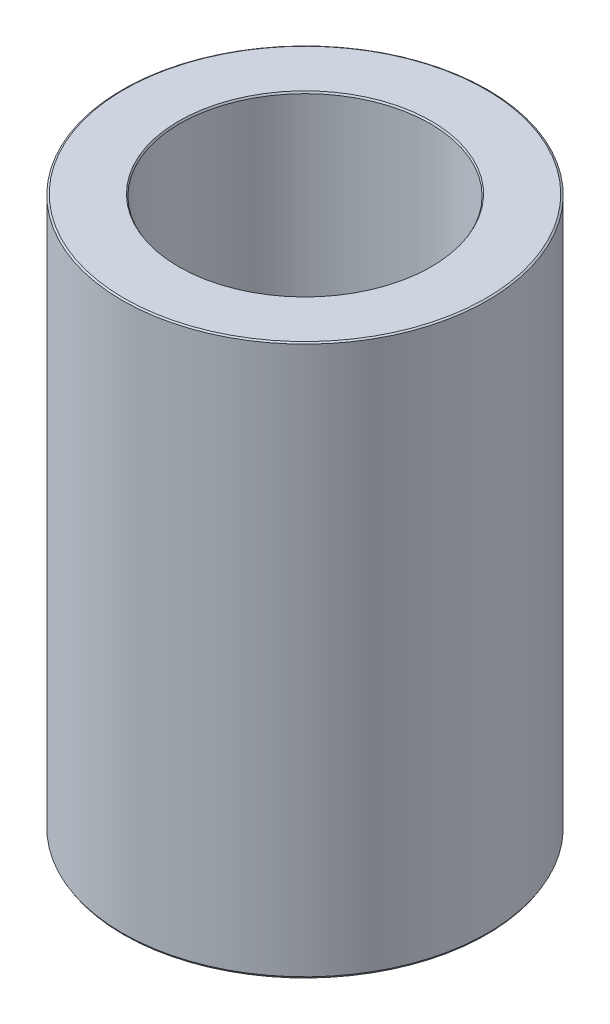
ISO-10303-21;
HEADER;
FILE_DESCRIPTION(('STEP AP214'),'2;1');
FILE_NAME('part.step','',(''),(''),'','','');
FILE_SCHEMA(('AUTOMOTIVE_DESIGN { 1 0 10303 214 1 1 1 1 }'));
ENDSEC;
DATA;
#1=APPLICATION_CONTEXT('core data for automotive mechanical design processes');
#2=APPLICATION_PROTOCOL_DEFINITION('international standard','automotive_design',2000,#1);
#3=PRODUCT_CONTEXT('',#1,'mechanical');
#4=PRODUCT('Part','Part','',(#3));
#5=PRODUCT_RELATED_PRODUCT_CATEGORY('part','',(#4));
#6=PRODUCT_DEFINITION_FORMATION('','',#4);
#7=PRODUCT_DEFINITION_CONTEXT('part definition',#1,'design');
#8=PRODUCT_DEFINITION('design','',#6,#7);
#9=PRODUCT_DEFINITION_SHAPE('','',#8);
#10=(LENGTH_UNIT() NAMED_UNIT(*) SI_UNIT(.MILLI.,.METRE.));
#11=(NAMED_UNIT(*) PLANE_ANGLE_UNIT() SI_UNIT($,.RADIAN.));
#12=(NAMED_UNIT(*) SI_UNIT($,.STERADIAN.) SOLID_ANGLE_UNIT());
#13=UNCERTAINTY_MEASURE_WITH_UNIT(LENGTH_MEASURE(1.E-05),#10,'distance_accuracy_value','');
#14=(GEOMETRIC_REPRESENTATION_CONTEXT(3) GLOBAL_UNCERTAINTY_ASSIGNED_CONTEXT((#13)) GLOBAL_UNIT_ASSIGNED_CONTEXT((#10,
#11,#12)) REPRESENTATION_CONTEXT('',''));
#15=CARTESIAN_POINT('',(0.,0.,0.));
#16=DIRECTION('',(0.,0.,1.));
#17=DIRECTION('',(1.,0.,0.));
#18=AXIS2_PLACEMENT_3D('',#15,#16,#17);
#19=CARTESIAN_POINT('',(0.,150.78002260161,0.));
#20=DIRECTION('',(0.,-1.,0.));
#21=DIRECTION('',(0.,0.,-1.));
#22=AXIS2_PLACEMENT_3D('',#19,#20,#21);
#23=CYLINDRICAL_SURFACE('',#22,50.);
#24=CARTESIAN_POINT('',(0.,0.477102646507604,0.));
#25=DIRECTION('',(0.,1.,0.));
#26=DIRECTION('',(0.,0.,1.));
#27=AXIS2_PLACEMENT_3D('',#24,#25,#26);
#28=CIRCLE('',#27,50.);
#29=CARTESIAN_POINT('',(0.,0.477102646507604,50.));
#30=VERTEX_POINT('',#29);
#31=EDGE_CURVE('E10',#30,#30,#28,.T.);
#32=ORIENTED_EDGE('',*,*,#31,.T.);
#33=EDGE_LOOP('',(#32));
#34=FACE_BOUND('',#33,.T.);
#35=CARTESIAN_POINT('',(0.,150.504567260218,0.));
#36=DIRECTION('',(0.,1.,0.));
#37=DIRECTION('',(0.,0.,1.));
#38=AXIS2_PLACEMENT_3D('',#35,#36,#37);
#39=CIRCLE('',#38,50.);
#40=CARTESIAN_POINT('',(0.,150.504567260218,50.));
#41=VERTEX_POINT('',#40);
#42=EDGE_CURVE('E50',#41,#41,#39,.F.);
#43=ORIENTED_EDGE('',*,*,#42,.T.);
#44=EDGE_LOOP('',(#43));
#45=FACE_BOUND('',#44,.T.);
#46=ADVANCED_FACE('F39',(#34,#45),#23,.T.);
#47=CARTESIAN_POINT('',(0.,150.78002260161,0.));
#48=DIRECTION('',(0.,1.,0.));
#49=DIRECTION('',(0.,0.,1.));
#50=AXIS2_PLACEMENT_3D('',#47,#48,#49);
#51=PLANE('',#50);
#52=CARTESIAN_POINT('',(0.,150.78002260161,0.));
#53=DIRECTION('',(0.,1.,0.));
#54=DIRECTION('',(0.,0.,1.));
#55=AXIS2_PLACEMENT_3D('',#52,#53,#54);
#56=CIRCLE('',#55,34.5738859034146);
#57=CARTESIAN_POINT('',(0.,150.78002260161,34.5738859034146));
#58=VERTEX_POINT('',#57);
#59=EDGE_CURVE('E58',#58,#58,#56,.F.);
#60=ORIENTED_EDGE('',*,*,#59,.T.);
#61=EDGE_LOOP('',(#60));
#62=FACE_BOUND('',#61,.T.);
#63=CARTESIAN_POINT('',(0.,150.78002260161,0.));
#64=DIRECTION('',(0.,1.,0.));
#65=DIRECTION('',(0.,0.,1.));
#66=AXIS2_PLACEMENT_3D('',#63,#64,#65);
#67=CIRCLE('',#66,49.5228973534925);
#68=CARTESIAN_POINT('',(0.,150.78002260161,49.5228973534925));
#69=VERTEX_POINT('',#68);
#70=EDGE_CURVE('E61',#69,#69,#67,.T.);
#71=ORIENTED_EDGE('',*,*,#70,.T.);
#72=EDGE_LOOP('',(#71));
#73=FACE_BOUND('',#72,.T.);
#74=ADVANCED_FACE('F88',(#62,#73),#51,.T.);
#75=CARTESIAN_POINT('',(0.,0.,0.));
#76=DIRECTION('',(0.,1.,0.));
#77=DIRECTION('',(0.,0.,1.));
#78=AXIS2_PLACEMENT_3D('',#75,#76,#77);
#79=PLANE('',#78);
#80=CARTESIAN_POINT('',(0.,0.,0.));
#81=DIRECTION('',(0.,1.,0.));
#82=DIRECTION('',(0.,0.,1.));
#83=AXIS2_PLACEMENT_3D('',#80,#81,#82);
#84=CIRCLE('',#83,34.7755332085299);
#85=CARTESIAN_POINT('',(0.,0.,34.7755332085299));
#86=VERTEX_POINT('',#85);
#87=EDGE_CURVE('E51',#86,#86,#84,.T.);
#88=ORIENTED_EDGE('',*,*,#87,.T.);
#89=EDGE_LOOP('',(#88));
#90=FACE_BOUND('',#89,.T.);
#91=CARTESIAN_POINT('',(0.,0.,0.));
#92=DIRECTION('',(0.,1.,0.));
#93=DIRECTION('',(0.,0.,1.));
#94=AXIS2_PLACEMENT_3D('',#91,#92,#93);
#95=CIRCLE('',#94,49.7245446586077);
#96=CARTESIAN_POINT('',(0.,0.,49.7245446586077));
#97=VERTEX_POINT('',#96);
#98=EDGE_CURVE('E54',#97,#97,#95,.F.);
#99=ORIENTED_EDGE('',*,*,#98,.T.);
#100=EDGE_LOOP('',(#99));
#101=FACE_BOUND('',#100,.T.);
#102=ADVANCED_FACE('F83',(#90,#101),#79,.F.);
#103=CARTESIAN_POINT('',(0.,150.78002260161,0.));
#104=DIRECTION('',(0.,-1.,0.));
#105=DIRECTION('',(0.,0.,-1.));
#106=AXIS2_PLACEMENT_3D('',#103,#104,#105);
#107=CYLINDRICAL_SURFACE('',#106,34.2984305620224);
#108=CARTESIAN_POINT('',(0.,150.302919955103,0.));
#109=DIRECTION('',(0.,1.,0.));
#110=DIRECTION('',(0.,0.,1.));
#111=AXIS2_PLACEMENT_3D('',#108,#109,#110);
#112=CIRCLE('',#111,34.2984305620224);
#113=CARTESIAN_POINT('',(0.,150.302919955103,34.2984305620224));
#114=VERTEX_POINT('',#113);
#115=EDGE_CURVE('E67',#114,#114,#112,.T.);
#116=ORIENTED_EDGE('',*,*,#115,.T.);
#117=EDGE_LOOP('',(#116));
#118=FACE_BOUND('',#117,.T.);
#119=CARTESIAN_POINT('',(0.,0.275455341392228,0.));
#120=DIRECTION('',(0.,1.,0.));
#121=DIRECTION('',(0.,0.,1.));
#122=AXIS2_PLACEMENT_3D('',#119,#120,#121);
#123=CIRCLE('',#122,34.2984305620224);
#124=CARTESIAN_POINT('',(0.,0.275455341392228,34.2984305620224));
#125=VERTEX_POINT('',#124);
#126=EDGE_CURVE('E69',#125,#125,#123,.F.);
#127=ORIENTED_EDGE('',*,*,#126,.T.);
#128=EDGE_LOOP('',(#127));
#129=FACE_BOUND('',#128,.T.);
#130=ADVANCED_FACE('F71',(#118,#129),#107,.F.);
#131=CARTESIAN_POINT('',(0.,150.302919955103,0.));
#132=DIRECTION('',(0.,1.,0.));
#133=DIRECTION('',(0.,0.,1.));
#134=AXIS2_PLACEMENT_3D('',#131,#132,#133);
#135=CONICAL_SURFACE('',#134,34.2984305620224,0.523598775598314);
#136=ORIENTED_EDGE('',*,*,#59,.F.);
#137=EDGE_LOOP('',(#136));
#138=FACE_BOUND('',#137,.T.);
#139=ORIENTED_EDGE('',*,*,#115,.F.);
#140=EDGE_LOOP('',(#139));
#141=FACE_BOUND('',#140,.T.);
#142=ADVANCED_FACE('F77',(#138,#141),#135,.F.);
#143=CARTESIAN_POINT('',(0.,0.,0.));
#144=DIRECTION('',(0.,-1.,0.));
#145=DIRECTION('',(0.,0.,-1.));
#146=AXIS2_PLACEMENT_3D('',#143,#144,#145);
#147=CONICAL_SURFACE('',#146,34.7755332085299,1.04719755119658);
#148=ORIENTED_EDGE('',*,*,#126,.F.);
#149=EDGE_LOOP('',(#148));
#150=FACE_BOUND('',#149,.T.);
#151=ORIENTED_EDGE('',*,*,#87,.F.);
#152=EDGE_LOOP('',(#151));
#153=FACE_BOUND('',#152,.T.);
#154=ADVANCED_FACE('F73',(#150,#153),#147,.F.);
#155=CARTESIAN_POINT('',(0.,0.477102646507604,0.));
#156=DIRECTION('',(0.,1.,0.));
#157=DIRECTION('',(0.,0.,1.));
#158=AXIS2_PLACEMENT_3D('',#155,#156,#157);
#159=CONICAL_SURFACE('',#158,50.,0.52359877559831);
#160=ORIENTED_EDGE('',*,*,#98,.F.);
#161=EDGE_LOOP('',(#160));
#162=FACE_BOUND('',#161,.T.);
#163=ORIENTED_EDGE('',*,*,#31,.F.);
#164=EDGE_LOOP('',(#163));
#165=FACE_BOUND('',#164,.T.);
#166=ADVANCED_FACE('F76',(#162,#165),#159,.T.);
#167=CARTESIAN_POINT('',(0.,150.78002260161,0.));
#168=DIRECTION('',(0.,-1.,0.));
#169=DIRECTION('',(0.,0.,-1.));
#170=AXIS2_PLACEMENT_3D('',#167,#168,#169);
#171=CONICAL_SURFACE('',#170,49.5228973534925,1.04719755119661);
#172=ORIENTED_EDGE('',*,*,#42,.F.);
#173=EDGE_LOOP('',(#172));
#174=FACE_BOUND('',#173,.T.);
#175=ORIENTED_EDGE('',*,*,#70,.F.);
#176=EDGE_LOOP('',(#175));
#177=FACE_BOUND('',#176,.T.);
#178=ADVANCED_FACE('F45',(#174,#177),#171,.T.);
#179=CLOSED_SHELL('',(#46,#74,#102,#130,#142,#154,#166,#178));
#180=MANIFOLD_SOLID_BREP('B2',#179);
#181=ADVANCED_BREP_SHAPE_REPRESENTATION('',(#18,#180),#14);
#182=SHAPE_DEFINITION_REPRESENTATION(#9,#181);
ENDSEC;
END-ISO-10303-21;
